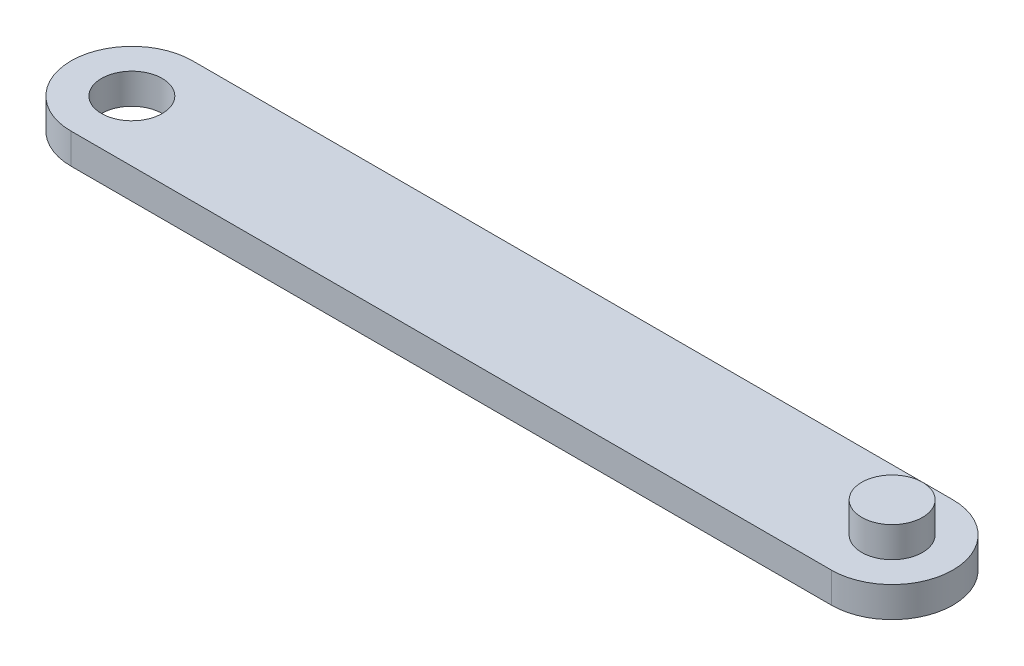
ISO-10303-21;
HEADER;
FILE_DESCRIPTION(('STEP AP214'),'2;1');
FILE_NAME('part.step','',(''),(''),'','','');
FILE_SCHEMA(('AUTOMOTIVE_DESIGN { 1 0 10303 214 1 1 1 1 }'));
ENDSEC;
DATA;
#1=APPLICATION_CONTEXT('core data for automotive mechanical design processes');
#2=APPLICATION_PROTOCOL_DEFINITION('international standard','automotive_design',2000,#1);
#3=PRODUCT_CONTEXT('',#1,'mechanical');
#4=PRODUCT('Part','Part','',(#3));
#5=PRODUCT_RELATED_PRODUCT_CATEGORY('part','',(#4));
#6=PRODUCT_DEFINITION_FORMATION('','',#4);
#7=PRODUCT_DEFINITION_CONTEXT('part definition',#1,'design');
#8=PRODUCT_DEFINITION('design','',#6,#7);
#9=PRODUCT_DEFINITION_SHAPE('','',#8);
#10=(LENGTH_UNIT() NAMED_UNIT(*) SI_UNIT(.MILLI.,.METRE.));
#11=(NAMED_UNIT(*) PLANE_ANGLE_UNIT() SI_UNIT($,.RADIAN.));
#12=(NAMED_UNIT(*) SI_UNIT($,.STERADIAN.) SOLID_ANGLE_UNIT());
#13=UNCERTAINTY_MEASURE_WITH_UNIT(LENGTH_MEASURE(1.E-05),#10,'distance_accuracy_value','');
#14=(GEOMETRIC_REPRESENTATION_CONTEXT(3) GLOBAL_UNCERTAINTY_ASSIGNED_CONTEXT((#13)) GLOBAL_UNIT_ASSIGNED_CONTEXT((#10,
#11,#12)) REPRESENTATION_CONTEXT('',''));
#15=CARTESIAN_POINT('',(0.,0.,0.));
#16=DIRECTION('',(0.,0.,1.));
#17=DIRECTION('',(1.,0.,0.));
#18=AXIS2_PLACEMENT_3D('',#15,#16,#17);
#19=CARTESIAN_POINT('',(-12.5,1.,0.));
#20=DIRECTION('',(0.,1.,0.));
#21=DIRECTION('',(0.,0.,1.));
#22=AXIS2_PLACEMENT_3D('',#19,#20,#21);
#23=PLANE('',#22);
#24=CARTESIAN_POINT('',(-12.5,1.,0.));
#25=DIRECTION('',(0.,1.,0.));
#26=DIRECTION('',(0.,0.,1.));
#27=AXIS2_PLACEMENT_3D('',#24,#25,#26);
#28=CIRCLE('',#27,1.);
#29=CARTESIAN_POINT('',(-12.5,1.,1.));
#30=VERTEX_POINT('',#29);
#31=EDGE_CURVE('E112',#30,#30,#28,.T.);
#32=ORIENTED_EDGE('',*,*,#31,.F.);
#33=EDGE_LOOP('',(#32));
#34=FACE_BOUND('',#33,.T.);
#35=CARTESIAN_POINT('',(-12.5,1.,0.));
#36=DIRECTION('',(0.,1.,0.));
#37=DIRECTION('',(0.,0.,1.));
#38=AXIS2_PLACEMENT_3D('',#35,#36,#37);
#39=CIRCLE('',#38,2.);
#40=CARTESIAN_POINT('',(-12.5,1.,-2.));
#41=VERTEX_POINT('',#40);
#42=CARTESIAN_POINT('',(-12.5,1.,2.));
#43=VERTEX_POINT('',#42);
#44=EDGE_CURVE('E92',#41,#43,#39,.T.);
#45=ORIENTED_EDGE('',*,*,#44,.T.);
#46=DIRECTION('',(1.,0.,0.));
#47=VECTOR('',#46,1.);
#48=CARTESIAN_POINT('',(-12.5,1.,2.));
#49=LINE('',#48,#47);
#50=CARTESIAN_POINT('',(12.5,1.,2.));
#51=VERTEX_POINT('',#50);
#52=EDGE_CURVE('E87',#43,#51,#49,.T.);
#53=ORIENTED_EDGE('',*,*,#52,.T.);
#54=CARTESIAN_POINT('',(12.5,1.,0.));
#55=DIRECTION('',(0.,1.,0.));
#56=DIRECTION('',(0.,0.,1.));
#57=AXIS2_PLACEMENT_3D('',#54,#55,#56);
#58=CIRCLE('',#57,2.);
#59=CARTESIAN_POINT('',(12.5,1.,-2.));
#60=VERTEX_POINT('',#59);
#61=EDGE_CURVE('E90',#51,#60,#58,.T.);
#62=ORIENTED_EDGE('',*,*,#61,.T.);
#63=DIRECTION('',(-1.,0.,0.));
#64=VECTOR('',#63,1.);
#65=CARTESIAN_POINT('',(-12.5,1.,-2.));
#66=LINE('',#65,#64);
#67=EDGE_CURVE('E57',#60,#41,#66,.T.);
#68=ORIENTED_EDGE('',*,*,#67,.T.);
#69=EDGE_LOOP('',(#45,#53,#62,#68));
#70=FACE_BOUND('',#69,.T.);
#71=CARTESIAN_POINT('',(12.5,1.,0.));
#72=DIRECTION('',(0.,1.,0.));
#73=DIRECTION('',(0.,0.,1.));
#74=AXIS2_PLACEMENT_3D('',#71,#72,#73);
#75=CIRCLE('',#74,1.);
#76=CARTESIAN_POINT('',(12.5,1.,1.));
#77=VERTEX_POINT('',#76);
#78=EDGE_CURVE('E134',#77,#77,#75,.T.);
#79=ORIENTED_EDGE('',*,*,#78,.F.);
#80=EDGE_LOOP('',(#79));
#81=FACE_BOUND('',#80,.T.);
#82=ADVANCED_FACE('F39',(#34,#70,#81),#23,.T.);
#83=CARTESIAN_POINT('',(-12.5,0.,0.));
#84=DIRECTION('',(0.,1.,0.));
#85=DIRECTION('',(0.,0.,1.));
#86=AXIS2_PLACEMENT_3D('',#83,#84,#85);
#87=PLANE('',#86);
#88=CARTESIAN_POINT('',(-12.5,0.,0.));
#89=DIRECTION('',(0.,1.,0.));
#90=DIRECTION('',(0.,0.,1.));
#91=AXIS2_PLACEMENT_3D('',#88,#89,#90);
#92=CIRCLE('',#91,2.);
#93=CARTESIAN_POINT('',(-12.5,0.,-2.));
#94=VERTEX_POINT('',#93);
#95=CARTESIAN_POINT('',(-12.5,0.,2.));
#96=VERTEX_POINT('',#95);
#97=EDGE_CURVE('E108',#94,#96,#92,.T.);
#98=ORIENTED_EDGE('',*,*,#97,.F.);
#99=DIRECTION('',(-1.,0.,0.));
#100=VECTOR('',#99,1.);
#101=CARTESIAN_POINT('',(-12.5,0.,-2.));
#102=LINE('',#101,#100);
#103=CARTESIAN_POINT('',(12.5,0.,-2.));
#104=VERTEX_POINT('',#103);
#105=EDGE_CURVE('E80',#104,#94,#102,.T.);
#106=ORIENTED_EDGE('',*,*,#105,.F.);
#107=CARTESIAN_POINT('',(12.5,0.,0.));
#108=DIRECTION('',(0.,1.,0.));
#109=DIRECTION('',(0.,0.,1.));
#110=AXIS2_PLACEMENT_3D('',#107,#108,#109);
#111=CIRCLE('',#110,2.);
#112=CARTESIAN_POINT('',(12.5,0.,2.));
#113=VERTEX_POINT('',#112);
#114=EDGE_CURVE('E74',#113,#104,#111,.T.);
#115=ORIENTED_EDGE('',*,*,#114,.F.);
#116=DIRECTION('',(1.,0.,0.));
#117=VECTOR('',#116,1.);
#118=CARTESIAN_POINT('',(-12.5,0.,2.));
#119=LINE('',#118,#117);
#120=EDGE_CURVE('E97',#96,#113,#119,.T.);
#121=ORIENTED_EDGE('',*,*,#120,.F.);
#122=EDGE_LOOP('',(#98,#106,#115,#121));
#123=FACE_BOUND('',#122,.T.);
#124=CARTESIAN_POINT('',(-12.5,0.,0.));
#125=DIRECTION('',(0.,1.,0.));
#126=DIRECTION('',(0.,0.,1.));
#127=AXIS2_PLACEMENT_3D('',#124,#125,#126);
#128=CIRCLE('',#127,1.);
#129=CARTESIAN_POINT('',(-12.5,0.,1.));
#130=VERTEX_POINT('',#129);
#131=EDGE_CURVE('E130',#130,#130,#128,.T.);
#132=ORIENTED_EDGE('',*,*,#131,.T.);
#133=EDGE_LOOP('',(#132));
#134=FACE_BOUND('',#133,.T.);
#135=ADVANCED_FACE('F125',(#123,#134),#87,.F.);
#136=CARTESIAN_POINT('',(-12.5,1.,0.));
#137=DIRECTION('',(0.,-1.,0.));
#138=DIRECTION('',(0.,0.,-1.));
#139=AXIS2_PLACEMENT_3D('',#136,#137,#138);
#140=CYLINDRICAL_SURFACE('',#139,2.);
#141=ORIENTED_EDGE('',*,*,#97,.T.);
#142=DIRECTION('',(0.,-1.,0.));
#143=VECTOR('',#142,1.);
#144=CARTESIAN_POINT('',(-12.5,1.,2.));
#145=LINE('',#144,#143);
#146=EDGE_CURVE('E11',#43,#96,#145,.T.);
#147=ORIENTED_EDGE('',*,*,#146,.F.);
#148=ORIENTED_EDGE('',*,*,#44,.F.);
#149=DIRECTION('',(0.,-1.,0.));
#150=VECTOR('',#149,1.);
#151=CARTESIAN_POINT('',(-12.5,1.,-2.));
#152=LINE('',#151,#150);
#153=EDGE_CURVE('E104',#41,#94,#152,.T.);
#154=ORIENTED_EDGE('',*,*,#153,.T.);
#155=EDGE_LOOP('',(#141,#147,#148,#154));
#156=FACE_BOUND('',#155,.T.);
#157=ADVANCED_FACE('F41',(#156),#140,.T.);
#158=CARTESIAN_POINT('',(-12.5,1.,2.));
#159=DIRECTION('',(0.,0.,-1.));
#160=DIRECTION('',(-1.,0.,0.));
#161=AXIS2_PLACEMENT_3D('',#158,#159,#160);
#162=PLANE('',#161);
#163=ORIENTED_EDGE('',*,*,#120,.T.);
#164=DIRECTION('',(0.,-1.,0.));
#165=VECTOR('',#164,1.);
#166=CARTESIAN_POINT('',(12.5,1.,2.));
#167=LINE('',#166,#165);
#168=EDGE_CURVE('E49',#51,#113,#167,.T.);
#169=ORIENTED_EDGE('',*,*,#168,.F.);
#170=ORIENTED_EDGE('',*,*,#52,.F.);
#171=ORIENTED_EDGE('',*,*,#146,.T.);
#172=EDGE_LOOP('',(#163,#169,#170,#171));
#173=FACE_BOUND('',#172,.T.);
#174=ADVANCED_FACE('F96',(#173),#162,.F.);
#175=CARTESIAN_POINT('',(12.5,1.,0.));
#176=DIRECTION('',(0.,-1.,0.));
#177=DIRECTION('',(0.,0.,-1.));
#178=AXIS2_PLACEMENT_3D('',#175,#176,#177);
#179=CYLINDRICAL_SURFACE('',#178,2.);
#180=ORIENTED_EDGE('',*,*,#114,.T.);
#181=DIRECTION('',(0.,-1.,0.));
#182=VECTOR('',#181,1.);
#183=CARTESIAN_POINT('',(12.5,1.,-2.));
#184=LINE('',#183,#182);
#185=EDGE_CURVE('E99',#60,#104,#184,.T.);
#186=ORIENTED_EDGE('',*,*,#185,.F.);
#187=ORIENTED_EDGE('',*,*,#61,.F.);
#188=ORIENTED_EDGE('',*,*,#168,.T.);
#189=EDGE_LOOP('',(#180,#186,#187,#188));
#190=FACE_BOUND('',#189,.T.);
#191=ADVANCED_FACE('F100',(#190),#179,.T.);
#192=CARTESIAN_POINT('',(-12.5,1.,-2.));
#193=DIRECTION('',(0.,0.,1.));
#194=DIRECTION('',(1.,0.,0.));
#195=AXIS2_PLACEMENT_3D('',#192,#193,#194);
#196=PLANE('',#195);
#197=ORIENTED_EDGE('',*,*,#105,.T.);
#198=ORIENTED_EDGE('',*,*,#153,.F.);
#199=ORIENTED_EDGE('',*,*,#67,.F.);
#200=ORIENTED_EDGE('',*,*,#185,.T.);
#201=EDGE_LOOP('',(#197,#198,#199,#200));
#202=FACE_BOUND('',#201,.T.);
#203=ADVANCED_FACE('F122',(#202),#196,.F.);
#204=CARTESIAN_POINT('',(-12.5,1.,0.));
#205=DIRECTION('',(0.,-1.,0.));
#206=DIRECTION('',(0.,0.,-1.));
#207=AXIS2_PLACEMENT_3D('',#204,#205,#206);
#208=CYLINDRICAL_SURFACE('',#207,1.);
#209=ORIENTED_EDGE('',*,*,#31,.T.);
#210=EDGE_LOOP('',(#209));
#211=FACE_BOUND('',#210,.T.);
#212=ORIENTED_EDGE('',*,*,#131,.F.);
#213=EDGE_LOOP('',(#212));
#214=FACE_BOUND('',#213,.T.);
#215=ADVANCED_FACE('F150',(#211,#214),#208,.F.);
#216=CARTESIAN_POINT('',(12.5,2.,0.));
#217=DIRECTION('',(0.,-1.,0.));
#218=DIRECTION('',(0.,0.,-1.));
#219=AXIS2_PLACEMENT_3D('',#216,#217,#218);
#220=CYLINDRICAL_SURFACE('',#219,1.);
#221=ORIENTED_EDGE('',*,*,#78,.T.);
#222=EDGE_LOOP('',(#221));
#223=FACE_BOUND('',#222,.T.);
#224=CARTESIAN_POINT('',(12.5,2.,0.));
#225=DIRECTION('',(0.,1.,0.));
#226=DIRECTION('',(0.,0.,1.));
#227=AXIS2_PLACEMENT_3D('',#224,#225,#226);
#228=CIRCLE('',#227,1.);
#229=CARTESIAN_POINT('',(12.5,2.,1.));
#230=VERTEX_POINT('',#229);
#231=EDGE_CURVE('E141',#230,#230,#228,.T.);
#232=ORIENTED_EDGE('',*,*,#231,.F.);
#233=EDGE_LOOP('',(#232));
#234=FACE_BOUND('',#233,.T.);
#235=ADVANCED_FACE('F148',(#223,#234),#220,.T.);
#236=CARTESIAN_POINT('',(12.5,2.,0.));
#237=DIRECTION('',(0.,1.,0.));
#238=DIRECTION('',(0.,0.,1.));
#239=AXIS2_PLACEMENT_3D('',#236,#237,#238);
#240=PLANE('',#239);
#241=ORIENTED_EDGE('',*,*,#231,.T.);
#242=EDGE_LOOP('',(#241));
#243=FACE_BOUND('',#242,.T.);
#244=ADVANCED_FACE('F146',(#243),#240,.T.);
#245=CLOSED_SHELL('',(#82,#135,#157,#174,#191,#203,#215,#235,#244));
#246=MANIFOLD_SOLID_BREP('B2',#245);
#247=ADVANCED_BREP_SHAPE_REPRESENTATION('',(#18,#246),#14);
#248=SHAPE_DEFINITION_REPRESENTATION(#9,#247);
ENDSEC;
END-ISO-10303-21;
